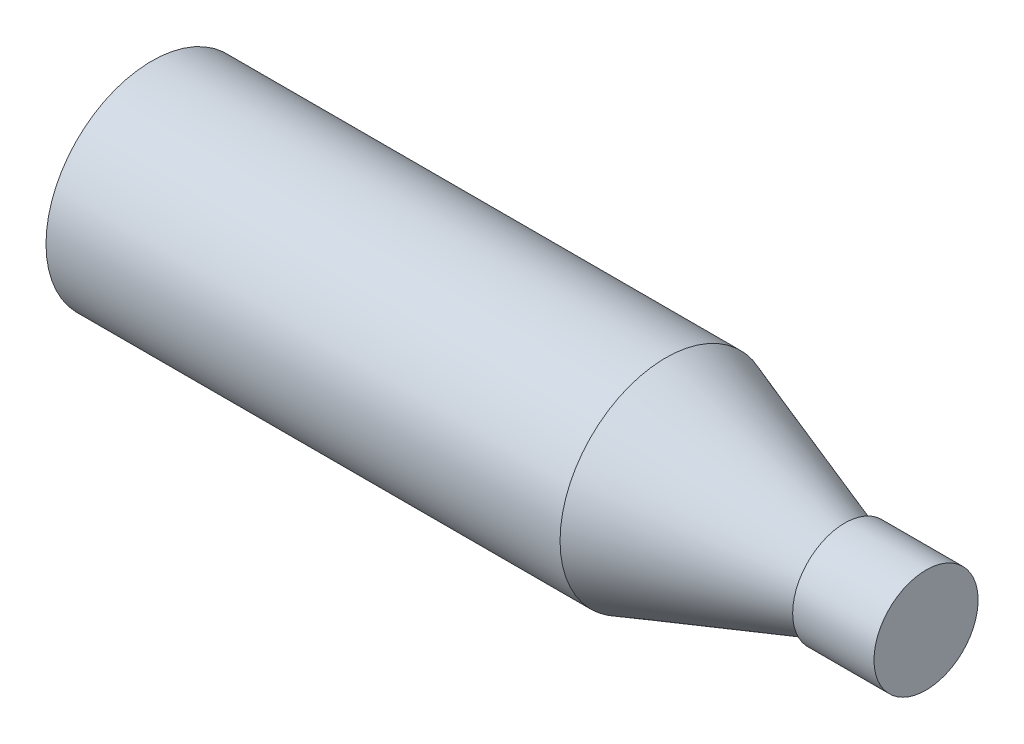
ISO-10303-21;
HEADER;
FILE_DESCRIPTION(('STEP AP214'),'2;1');
FILE_NAME('part.step','',(''),(''),'','','');
FILE_SCHEMA(('AUTOMOTIVE_DESIGN { 1 0 10303 214 1 1 1 1 }'));
ENDSEC;
DATA;
#1=APPLICATION_CONTEXT('core data for automotive mechanical design processes');
#2=APPLICATION_PROTOCOL_DEFINITION('international standard','automotive_design',2000,#1);
#3=PRODUCT_CONTEXT('',#1,'mechanical');
#4=PRODUCT('Part','Part','',(#3));
#5=PRODUCT_RELATED_PRODUCT_CATEGORY('part','',(#4));
#6=PRODUCT_DEFINITION_FORMATION('','',#4);
#7=PRODUCT_DEFINITION_CONTEXT('part definition',#1,'design');
#8=PRODUCT_DEFINITION('design','',#6,#7);
#9=PRODUCT_DEFINITION_SHAPE('','',#8);
#10=(LENGTH_UNIT() NAMED_UNIT(*) SI_UNIT(.MILLI.,.METRE.));
#11=(NAMED_UNIT(*) PLANE_ANGLE_UNIT() SI_UNIT($,.RADIAN.));
#12=(NAMED_UNIT(*) SI_UNIT($,.STERADIAN.) SOLID_ANGLE_UNIT());
#13=UNCERTAINTY_MEASURE_WITH_UNIT(LENGTH_MEASURE(1.E-05),#10,'distance_accuracy_value','');
#14=(GEOMETRIC_REPRESENTATION_CONTEXT(3) GLOBAL_UNCERTAINTY_ASSIGNED_CONTEXT((#13)) GLOBAL_UNIT_ASSIGNED_CONTEXT((#10,
#11,#12)) REPRESENTATION_CONTEXT('',''));
#15=CARTESIAN_POINT('',(0.,0.,0.));
#16=DIRECTION('',(0.,0.,1.));
#17=DIRECTION('',(1.,0.,0.));
#18=AXIS2_PLACEMENT_3D('',#15,#16,#17);
#19=CARTESIAN_POINT('',(-50.7749378945587,0.,0.));
#20=DIRECTION('',(1.,0.,0.));
#21=DIRECTION('',(0.,0.,-1.));
#22=AXIS2_PLACEMENT_3D('',#19,#20,#21);
#23=PLANE('',#22);
#24=CARTESIAN_POINT('',(-50.7749378945587,0.,0.));
#25=DIRECTION('',(-1.,0.,0.));
#26=DIRECTION('',(0.,0.,1.));
#27=AXIS2_PLACEMENT_3D('',#24,#25,#26);
#28=CIRCLE('',#27,32.5);
#29=CARTESIAN_POINT('',(-50.7749378945587,0.,32.5));
#30=VERTEX_POINT('',#29);
#31=EDGE_CURVE('E10',#30,#30,#28,.T.);
#32=ORIENTED_EDGE('',*,*,#31,.T.);
#33=EDGE_LOOP('',(#32));
#34=FACE_BOUND('',#33,.T.);
#35=ADVANCED_FACE('F31',(#34),#23,.F.);
#36=CARTESIAN_POINT('',(-50.7749378945587,0.,0.));
#37=DIRECTION('',(-1.,0.,0.));
#38=DIRECTION('',(0.,0.,1.));
#39=AXIS2_PLACEMENT_3D('',#36,#37,#38);
#40=CYLINDRICAL_SURFACE('',#39,32.5);
#41=ORIENTED_EDGE('',*,*,#31,.F.);
#42=EDGE_LOOP('',(#41));
#43=FACE_BOUND('',#42,.T.);
#44=CARTESIAN_POINT('',(107.225062105441,0.,0.));
#45=DIRECTION('',(-1.,0.,0.));
#46=DIRECTION('',(0.,0.,1.));
#47=AXIS2_PLACEMENT_3D('',#44,#45,#46);
#48=CIRCLE('',#47,32.5);
#49=CARTESIAN_POINT('',(107.225062105441,0.,32.5));
#50=VERTEX_POINT('',#49);
#51=EDGE_CURVE('E37',#50,#50,#48,.T.);
#52=ORIENTED_EDGE('',*,*,#51,.T.);
#53=EDGE_LOOP('',(#52));
#54=FACE_BOUND('',#53,.T.);
#55=ADVANCED_FACE('F66',(#43,#54),#40,.T.);
#56=CARTESIAN_POINT('',(162.225062105441,0.,0.));
#57=DIRECTION('',(-1.,0.,0.));
#58=DIRECTION('',(0.,0.,1.));
#59=AXIS2_PLACEMENT_3D('',#56,#57,#58);
#60=CONICAL_SURFACE('',#59,13.5,0.332619691573912);
#61=ORIENTED_EDGE('',*,*,#51,.F.);
#62=EDGE_LOOP('',(#61));
#63=FACE_BOUND('',#62,.T.);
#64=CARTESIAN_POINT('',(162.225062105441,0.,0.));
#65=DIRECTION('',(-1.,0.,0.));
#66=DIRECTION('',(0.,0.,1.));
#67=AXIS2_PLACEMENT_3D('',#64,#65,#66);
#68=CIRCLE('',#67,13.5);
#69=CARTESIAN_POINT('',(162.225062105441,0.,13.5));
#70=VERTEX_POINT('',#69);
#71=EDGE_CURVE('E41',#70,#70,#68,.T.);
#72=ORIENTED_EDGE('',*,*,#71,.T.);
#73=EDGE_LOOP('',(#72));
#74=FACE_BOUND('',#73,.T.);
#75=ADVANCED_FACE('F70',(#63,#74),#60,.T.);
#76=CARTESIAN_POINT('',(162.225062105441,13.5,0.));
#77=DIRECTION('',(1.,0.,0.));
#78=DIRECTION('',(0.,0.,-1.));
#79=AXIS2_PLACEMENT_3D('',#76,#77,#78);
#80=PLANE('',#79);
#81=ORIENTED_EDGE('',*,*,#71,.F.);
#82=EDGE_LOOP('',(#81));
#83=FACE_BOUND('',#82,.T.);
#84=CARTESIAN_POINT('',(162.225062105441,0.,0.));
#85=DIRECTION('',(-1.,0.,0.));
#86=DIRECTION('',(0.,0.,1.));
#87=AXIS2_PLACEMENT_3D('',#84,#85,#86);
#88=CIRCLE('',#87,16.);
#89=CARTESIAN_POINT('',(162.225062105441,0.,16.));
#90=VERTEX_POINT('',#89);
#91=EDGE_CURVE('E45',#90,#90,#88,.T.);
#92=ORIENTED_EDGE('',*,*,#91,.T.);
#93=EDGE_LOOP('',(#92));
#94=FACE_BOUND('',#93,.T.);
#95=ADVANCED_FACE('F62',(#83,#94),#80,.F.);
#96=CARTESIAN_POINT('',(-50.7749378945587,0.,0.));
#97=DIRECTION('',(-1.,0.,0.));
#98=DIRECTION('',(0.,0.,1.));
#99=AXIS2_PLACEMENT_3D('',#96,#97,#98);
#100=CYLINDRICAL_SURFACE('',#99,16.);
#101=ORIENTED_EDGE('',*,*,#91,.F.);
#102=EDGE_LOOP('',(#101));
#103=FACE_BOUND('',#102,.T.);
#104=CARTESIAN_POINT('',(187.225062105441,0.,0.));
#105=DIRECTION('',(-1.,0.,0.));
#106=DIRECTION('',(0.,0.,1.));
#107=AXIS2_PLACEMENT_3D('',#104,#105,#106);
#108=CIRCLE('',#107,16.);
#109=CARTESIAN_POINT('',(187.225062105441,0.,16.));
#110=VERTEX_POINT('',#109);
#111=EDGE_CURVE('E50',#110,#110,#108,.T.);
#112=ORIENTED_EDGE('',*,*,#111,.T.);
#113=EDGE_LOOP('',(#112));
#114=FACE_BOUND('',#113,.T.);
#115=ADVANCED_FACE('F54',(#103,#114),#100,.T.);
#116=CARTESIAN_POINT('',(187.225062105441,16.,0.));
#117=DIRECTION('',(-1.,0.,0.));
#118=DIRECTION('',(0.,0.,1.));
#119=AXIS2_PLACEMENT_3D('',#116,#117,#118);
#120=PLANE('',#119);
#121=ORIENTED_EDGE('',*,*,#111,.F.);
#122=EDGE_LOOP('',(#121));
#123=FACE_BOUND('',#122,.T.);
#124=ADVANCED_FACE('F56',(#123),#120,.F.);
#125=CLOSED_SHELL('',(#35,#55,#75,#95,#115,#124));
#126=MANIFOLD_SOLID_BREP('B2',#125);
#127=ADVANCED_BREP_SHAPE_REPRESENTATION('',(#18,#126),#14);
#128=SHAPE_DEFINITION_REPRESENTATION(#9,#127);
ENDSEC;
END-ISO-10303-21;
